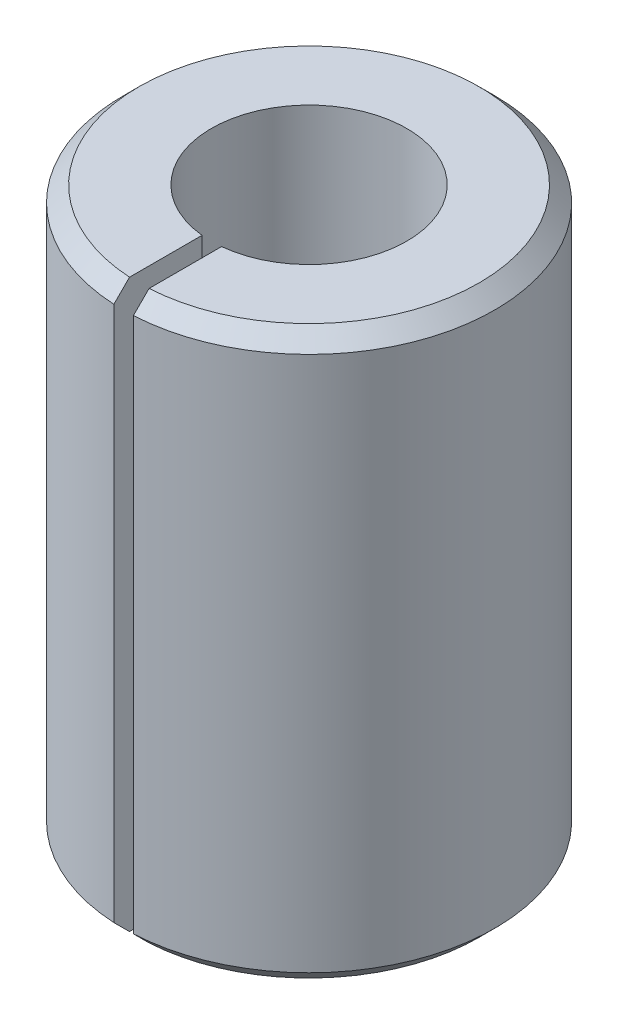
ISO-10303-21;
HEADER;
FILE_DESCRIPTION(('STEP AP214'),'2;1');
FILE_NAME('part.step','',(''),(''),'','','');
FILE_SCHEMA(('AUTOMOTIVE_DESIGN { 1 0 10303 214 1 1 1 1 }'));
ENDSEC;
DATA;
#1=APPLICATION_CONTEXT('core data for automotive mechanical design processes');
#2=APPLICATION_PROTOCOL_DEFINITION('international standard','automotive_design',2000,#1);
#3=PRODUCT_CONTEXT('',#1,'mechanical');
#4=PRODUCT('Part','Part','',(#3));
#5=PRODUCT_RELATED_PRODUCT_CATEGORY('part','',(#4));
#6=PRODUCT_DEFINITION_FORMATION('','',#4);
#7=PRODUCT_DEFINITION_CONTEXT('part definition',#1,'design');
#8=PRODUCT_DEFINITION('design','',#6,#7);
#9=PRODUCT_DEFINITION_SHAPE('','',#8);
#10=(LENGTH_UNIT() NAMED_UNIT(*) SI_UNIT(.MILLI.,.METRE.));
#11=(NAMED_UNIT(*) PLANE_ANGLE_UNIT() SI_UNIT($,.RADIAN.));
#12=(NAMED_UNIT(*) SI_UNIT($,.STERADIAN.) SOLID_ANGLE_UNIT());
#13=UNCERTAINTY_MEASURE_WITH_UNIT(LENGTH_MEASURE(1.E-05),#10,'distance_accuracy_value','');
#14=(GEOMETRIC_REPRESENTATION_CONTEXT(3) GLOBAL_UNCERTAINTY_ASSIGNED_CONTEXT((#13)) GLOBAL_UNIT_ASSIGNED_CONTEXT((#10,
#11,#12)) REPRESENTATION_CONTEXT('',''));
#15=CARTESIAN_POINT('',(0.,0.,0.));
#16=DIRECTION('',(0.,0.,1.));
#17=DIRECTION('',(1.,0.,0.));
#18=AXIS2_PLACEMENT_3D('',#15,#16,#17);
#19=CARTESIAN_POINT('',(0.5,29.,5.));
#20=DIRECTION('',(1.,0.,0.));
#21=DIRECTION('',(0.,0.,-1.));
#22=AXIS2_PLACEMENT_3D('',#19,#20,#21);
#23=PLANE('',#22);
#24=DIRECTION('',(0.,0.,1.));
#25=VECTOR('',#24,1.);
#26=CARTESIAN_POINT('',(0.5,0.,5.));
#27=LINE('',#26,#25);
#28=CARTESIAN_POINT('',(0.5,0.,4.9749371855331));
#29=VERTEX_POINT('',#28);
#30=CARTESIAN_POINT('',(0.5,0.,8.68562030024336));
#31=VERTEX_POINT('',#30);
#32=EDGE_CURVE('E119',#29,#31,#27,.T.);
#33=ORIENTED_EDGE('',*,*,#32,.T.);
#34=CARTESIAN_POINT('',(0.5,0.,8.68562030024336));
#35=CARTESIAN_POINT('',(0.5,0.133324429034899,8.81916463778797));
#36=CARTESIAN_POINT('',(0.500000000000001,0.266653310222274,8.95270452991868));
#37=CARTESIAN_POINT('',(0.500000000000001,0.533319976888949,9.21977542333928));
#38=CARTESIAN_POINT('',(0.500000000000001,0.666657762368248,9.35330642462915));
#39=CARTESIAN_POINT('',(0.500000000000001,0.800000000000023,9.48683298050514));
#40=B_SPLINE_CURVE_WITH_KNOTS('',3,(#34,#35,#36,#37,#38,#39),.UNSPECIFIED.,.F.,.F.,(4,2,4),(0.,
0.566114334865885,1.13222866967645),.UNSPECIFIED.);
#41=CARTESIAN_POINT('',(0.500000000000001,0.80000000000003,9.48683298050514));
#42=VERTEX_POINT('',#41);
#43=EDGE_CURVE('E45',#31,#42,#40,.T.);
#44=ORIENTED_EDGE('',*,*,#43,.T.);
#45=DIRECTION('',(0.,-1.,0.));
#46=VECTOR('',#45,1.);
#47=CARTESIAN_POINT('',(0.500000000000001,29.,9.48683298050514));
#48=LINE('',#47,#46);
#49=CARTESIAN_POINT('',(0.500000000000001,28.2,9.48683298050514));
#50=VERTEX_POINT('',#49);
#51=EDGE_CURVE('E125',#50,#42,#48,.T.);
#52=ORIENTED_EDGE('',*,*,#51,.F.);
#53=CARTESIAN_POINT('',(0.500000000000001,28.2,9.48683298050514));
#54=CARTESIAN_POINT('',(0.500000000000001,28.3333422376318,9.35330642462916));
#55=CARTESIAN_POINT('',(0.500000000000001,28.4666800231111,9.21977542333929));
#56=CARTESIAN_POINT('',(0.500000000000001,28.7333466897777,8.95270452991872));
#57=CARTESIAN_POINT('',(0.500000000000001,28.8666755709651,8.81916463778801));
#58=CARTESIAN_POINT('',(0.5,29.,8.68562030024341));
#59=B_SPLINE_CURVE_WITH_KNOTS('',3,(#53,#54,#55,#56,#57,#58),.UNSPECIFIED.,.F.,.F.,(4,2,4),(0.,
0.566114334810533,1.13222866967639),.UNSPECIFIED.);
#60=CARTESIAN_POINT('',(0.5,29.,8.68562030024341));
#61=VERTEX_POINT('',#60);
#62=EDGE_CURVE('E52',#50,#61,#59,.T.);
#63=ORIENTED_EDGE('',*,*,#62,.T.);
#64=DIRECTION('',(0.,0.,1.));
#65=VECTOR('',#64,1.);
#66=CARTESIAN_POINT('',(0.5,29.,5.));
#67=LINE('',#66,#65);
#68=CARTESIAN_POINT('',(0.5,29.,4.9749371855331));
#69=VERTEX_POINT('',#68);
#70=EDGE_CURVE('E100',#69,#61,#67,.T.);
#71=ORIENTED_EDGE('',*,*,#70,.F.);
#72=DIRECTION('',(0.,-1.,0.));
#73=VECTOR('',#72,1.);
#74=CARTESIAN_POINT('',(0.5,29.,4.9749371855331));
#75=LINE('',#74,#73);
#76=EDGE_CURVE('E111',#69,#29,#75,.T.);
#77=ORIENTED_EDGE('',*,*,#76,.T.);
#78=EDGE_LOOP('',(#33,#44,#52,#63,#71,#77));
#79=FACE_BOUND('',#78,.T.);
#80=ADVANCED_FACE('F36',(#79),#23,.F.);
#81=CARTESIAN_POINT('',(0.,29.,0.));
#82=DIRECTION('',(0.,-1.,0.));
#83=DIRECTION('',(0.,0.,-1.));
#84=AXIS2_PLACEMENT_3D('',#81,#82,#83);
#85=CYLINDRICAL_SURFACE('',#84,9.5);
#86=ORIENTED_EDGE('',*,*,#51,.T.);
#87=CARTESIAN_POINT('',(0.,0.800000000000023,0.));
#88=DIRECTION('',(0.,1.,0.));
#89=DIRECTION('',(0.,0.,1.));
#90=AXIS2_PLACEMENT_3D('',#87,#88,#89);
#91=CIRCLE('',#90,9.5);
#92=CARTESIAN_POINT('',(-0.500000000000001,0.80000000000003,9.48683298050514));
#93=VERTEX_POINT('',#92);
#94=EDGE_CURVE('E130',#42,#93,#91,.T.);
#95=ORIENTED_EDGE('',*,*,#94,.T.);
#96=DIRECTION('',(0.,-1.,0.));
#97=VECTOR('',#96,1.);
#98=CARTESIAN_POINT('',(-0.500000000000001,29.,9.48683298050514));
#99=LINE('',#98,#97);
#100=CARTESIAN_POINT('',(-0.500000000000001,28.2,9.48683298050514));
#101=VERTEX_POINT('',#100);
#102=EDGE_CURVE('E110',#101,#93,#99,.T.);
#103=ORIENTED_EDGE('',*,*,#102,.F.);
#104=CARTESIAN_POINT('',(0.,28.2,0.));
#105=DIRECTION('',(0.,1.,0.));
#106=DIRECTION('',(0.,0.,1.));
#107=AXIS2_PLACEMENT_3D('',#104,#105,#106);
#108=CIRCLE('',#107,9.5);
#109=EDGE_CURVE('E128',#101,#50,#108,.F.);
#110=ORIENTED_EDGE('',*,*,#109,.T.);
#111=EDGE_LOOP('',(#86,#95,#103,#110));
#112=FACE_BOUND('',#111,.T.);
#113=ADVANCED_FACE('F150',(#112),#85,.T.);
#114=CARTESIAN_POINT('',(-0.5,29.,5.));
#115=DIRECTION('',(-1.,0.,0.));
#116=DIRECTION('',(0.,0.,1.));
#117=AXIS2_PLACEMENT_3D('',#114,#115,#116);
#118=PLANE('',#117);
#119=ORIENTED_EDGE('',*,*,#102,.T.);
#120=CARTESIAN_POINT('',(-0.500000000000001,0.800000000000023,9.48683298050514));
#121=CARTESIAN_POINT('',(-0.5,0.666657762368248,9.35330642462915));
#122=CARTESIAN_POINT('',(-0.5,0.533319976888949,9.21977542333928));
#123=CARTESIAN_POINT('',(-0.5,0.266653310222274,8.95270452991868));
#124=CARTESIAN_POINT('',(-0.5,0.133324429034898,8.81916463778797));
#125=CARTESIAN_POINT('',(-0.5,0.,8.68562030024336));
#126=B_SPLINE_CURVE_WITH_KNOTS('',3,(#120,#121,#122,#123,#124,#125),.UNSPECIFIED.,.F.,.F.,(4,2,
4),(0.,0.566114334810564,1.13222866967645),.UNSPECIFIED.);
#127=CARTESIAN_POINT('',(-0.5,0.,8.68562030024336));
#128=VERTEX_POINT('',#127);
#129=EDGE_CURVE('E140',#93,#128,#126,.T.);
#130=ORIENTED_EDGE('',*,*,#129,.T.);
#131=DIRECTION('',(0.,0.,-1.));
#132=VECTOR('',#131,1.);
#133=CARTESIAN_POINT('',(-0.5,0.,5.));
#134=LINE('',#133,#132);
#135=CARTESIAN_POINT('',(-0.5,0.,4.9749371855331));
#136=VERTEX_POINT('',#135);
#137=EDGE_CURVE('E106',#128,#136,#134,.T.);
#138=ORIENTED_EDGE('',*,*,#137,.T.);
#139=DIRECTION('',(0.,-1.,0.));
#140=VECTOR('',#139,1.);
#141=CARTESIAN_POINT('',(-0.5,29.,4.9749371855331));
#142=LINE('',#141,#140);
#143=CARTESIAN_POINT('',(-0.5,29.,4.9749371855331));
#144=VERTEX_POINT('',#143);
#145=EDGE_CURVE('E103',#144,#136,#142,.T.);
#146=ORIENTED_EDGE('',*,*,#145,.F.);
#147=DIRECTION('',(0.,0.,-1.));
#148=VECTOR('',#147,1.);
#149=CARTESIAN_POINT('',(-0.5,29.,5.));
#150=LINE('',#149,#148);
#151=CARTESIAN_POINT('',(-0.5,29.,8.68562030024341));
#152=VERTEX_POINT('',#151);
#153=EDGE_CURVE('E92',#152,#144,#150,.T.);
#154=ORIENTED_EDGE('',*,*,#153,.F.);
#155=CARTESIAN_POINT('',(-0.5,29.,8.68562030024341));
#156=CARTESIAN_POINT('',(-0.5,28.8666755709651,8.81916463778801));
#157=CARTESIAN_POINT('',(-0.5,28.7333466897777,8.95270452991872));
#158=CARTESIAN_POINT('',(-0.5,28.4666800231111,9.21977542333929));
#159=CARTESIAN_POINT('',(-0.5,28.3333422376318,9.35330642462916));
#160=CARTESIAN_POINT('',(-0.5,28.2,9.48683298050514));
#161=B_SPLINE_CURVE_WITH_KNOTS('',3,(#155,#156,#157,#158,#159,#160),.UNSPECIFIED.,.F.,.F.,(4,2,
4),(0.,0.566114334865856,1.13222866967639),.UNSPECIFIED.);
#162=EDGE_CURVE('E133',#152,#101,#161,.T.);
#163=ORIENTED_EDGE('',*,*,#162,.T.);
#164=EDGE_LOOP('',(#119,#130,#138,#146,#154,#163));
#165=FACE_BOUND('',#164,.T.);
#166=ADVANCED_FACE('F105',(#165),#118,.F.);
#167=CARTESIAN_POINT('',(0.,29.,0.));
#168=DIRECTION('',(0.,-1.,0.));
#169=DIRECTION('',(0.,0.,-1.));
#170=AXIS2_PLACEMENT_3D('',#167,#168,#169);
#171=CYLINDRICAL_SURFACE('',#170,5.);
#172=CARTESIAN_POINT('',(0.,0.,0.));
#173=DIRECTION('',(0.,-1.,0.));
#174=DIRECTION('',(0.,0.,1.));
#175=AXIS2_PLACEMENT_3D('',#172,#173,#174);
#176=CIRCLE('',#175,5.);
#177=EDGE_CURVE('E122',#136,#29,#176,.T.);
#178=ORIENTED_EDGE('',*,*,#177,.T.);
#179=ORIENTED_EDGE('',*,*,#76,.F.);
#180=CARTESIAN_POINT('',(0.,29.,0.));
#181=DIRECTION('',(0.,-1.,0.));
#182=DIRECTION('',(0.,0.,1.));
#183=AXIS2_PLACEMENT_3D('',#180,#181,#182);
#184=CIRCLE('',#183,5.);
#185=EDGE_CURVE('E96',#144,#69,#184,.T.);
#186=ORIENTED_EDGE('',*,*,#185,.F.);
#187=ORIENTED_EDGE('',*,*,#145,.T.);
#188=EDGE_LOOP('',(#178,#179,#186,#187));
#189=FACE_BOUND('',#188,.T.);
#190=ADVANCED_FACE('F113',(#189),#171,.F.);
#191=CARTESIAN_POINT('',(0.,29.,0.));
#192=DIRECTION('',(0.,1.,0.));
#193=DIRECTION('',(0.,0.,1.));
#194=AXIS2_PLACEMENT_3D('',#191,#192,#193);
#195=PLANE('',#194);
#196=ORIENTED_EDGE('',*,*,#70,.T.);
#197=CARTESIAN_POINT('',(0.,29.,0.));
#198=DIRECTION('',(0.,1.,0.));
#199=DIRECTION('',(0.,0.,1.));
#200=AXIS2_PLACEMENT_3D('',#197,#198,#199);
#201=CIRCLE('',#200,8.70000000000002);
#202=EDGE_CURVE('E11',#61,#152,#201,.T.);
#203=ORIENTED_EDGE('',*,*,#202,.T.);
#204=ORIENTED_EDGE('',*,*,#153,.T.);
#205=ORIENTED_EDGE('',*,*,#185,.T.);
#206=EDGE_LOOP('',(#196,#203,#204,#205));
#207=FACE_BOUND('',#206,.T.);
#208=ADVANCED_FACE('F94',(#207),#195,.T.);
#209=CARTESIAN_POINT('',(0.,0.,0.));
#210=DIRECTION('',(0.,1.,0.));
#211=DIRECTION('',(0.,0.,1.));
#212=AXIS2_PLACEMENT_3D('',#209,#210,#211);
#213=PLANE('',#212);
#214=ORIENTED_EDGE('',*,*,#137,.F.);
#215=CARTESIAN_POINT('',(0.,0.,0.));
#216=DIRECTION('',(0.,1.,0.));
#217=DIRECTION('',(0.,0.,1.));
#218=AXIS2_PLACEMENT_3D('',#215,#216,#217);
#219=CIRCLE('',#218,8.69999999999997);
#220=EDGE_CURVE('E60',#128,#31,#219,.F.);
#221=ORIENTED_EDGE('',*,*,#220,.T.);
#222=ORIENTED_EDGE('',*,*,#32,.F.);
#223=ORIENTED_EDGE('',*,*,#177,.F.);
#224=EDGE_LOOP('',(#214,#221,#222,#223));
#225=FACE_BOUND('',#224,.T.);
#226=ADVANCED_FACE('F174',(#225),#213,.F.);
#227=CARTESIAN_POINT('',(0.,0.800000000000023,0.));
#228=DIRECTION('',(0.,1.,0.));
#229=DIRECTION('',(0.,0.,1.));
#230=AXIS2_PLACEMENT_3D('',#227,#228,#229);
#231=CONICAL_SURFACE('',#230,9.5,0.78539816339745);
#232=ORIENTED_EDGE('',*,*,#43,.F.);
#233=ORIENTED_EDGE('',*,*,#220,.F.);
#234=ORIENTED_EDGE('',*,*,#129,.F.);
#235=ORIENTED_EDGE('',*,*,#94,.F.);
#236=EDGE_LOOP('',(#232,#233,#234,#235));
#237=FACE_BOUND('',#236,.T.);
#238=ADVANCED_FACE('F158',(#237),#231,.T.);
#239=CARTESIAN_POINT('',(0.,29.,0.));
#240=DIRECTION('',(0.,-1.,0.));
#241=DIRECTION('',(0.,0.,-1.));
#242=AXIS2_PLACEMENT_3D('',#239,#240,#241);
#243=CONICAL_SURFACE('',#242,8.70000000000002,0.785398163397446);
#244=ORIENTED_EDGE('',*,*,#62,.F.);
#245=ORIENTED_EDGE('',*,*,#109,.F.);
#246=ORIENTED_EDGE('',*,*,#162,.F.);
#247=ORIENTED_EDGE('',*,*,#202,.F.);
#248=EDGE_LOOP('',(#244,#245,#246,#247));
#249=FACE_BOUND('',#248,.T.);
#250=ADVANCED_FACE('F38',(#249),#243,.T.);
#251=CLOSED_SHELL('',(#80,#113,#166,#190,#208,#226,#238,#250));
#252=MANIFOLD_SOLID_BREP('B2',#251);
#253=ADVANCED_BREP_SHAPE_REPRESENTATION('',(#18,#252),#14);
#254=SHAPE_DEFINITION_REPRESENTATION(#9,#253);
ENDSEC;
END-ISO-10303-21;
